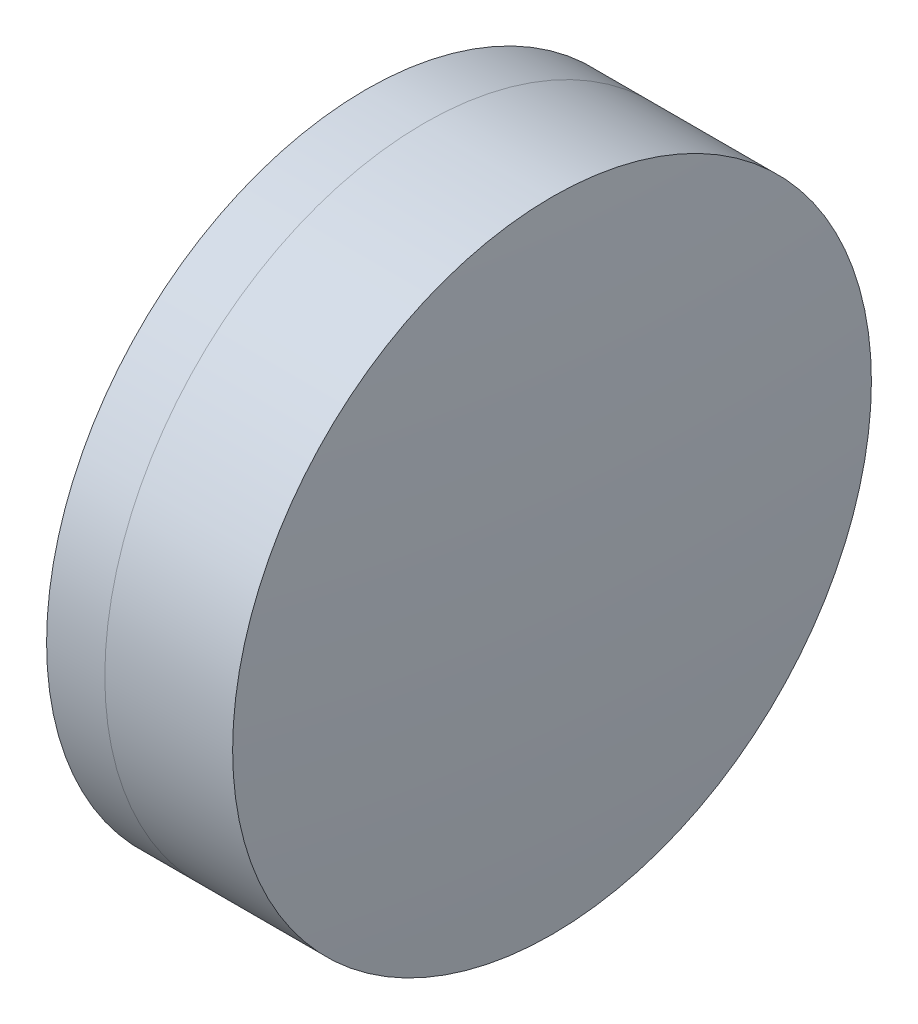
ISO-10303-21;
HEADER;
FILE_DESCRIPTION(('STEP AP214'),'2;1');
FILE_NAME('part.step','',(''),(''),'','','');
FILE_SCHEMA(('AUTOMOTIVE_DESIGN { 1 0 10303 214 1 1 1 1 }'));
ENDSEC;
DATA;
#1=APPLICATION_CONTEXT('core data for automotive mechanical design processes');
#2=APPLICATION_PROTOCOL_DEFINITION('international standard','automotive_design',2000,#1);
#3=PRODUCT_CONTEXT('',#1,'mechanical');
#4=PRODUCT('Part','Part','',(#3));
#5=PRODUCT_RELATED_PRODUCT_CATEGORY('part','',(#4));
#6=PRODUCT_DEFINITION_FORMATION('','',#4);
#7=PRODUCT_DEFINITION_CONTEXT('part definition',#1,'design');
#8=PRODUCT_DEFINITION('design','',#6,#7);
#9=PRODUCT_DEFINITION_SHAPE('','',#8);
#10=(LENGTH_UNIT() NAMED_UNIT(*) SI_UNIT(.MILLI.,.METRE.));
#11=(NAMED_UNIT(*) PLANE_ANGLE_UNIT() SI_UNIT($,.RADIAN.));
#12=(NAMED_UNIT(*) SI_UNIT($,.STERADIAN.) SOLID_ANGLE_UNIT());
#13=UNCERTAINTY_MEASURE_WITH_UNIT(LENGTH_MEASURE(1.E-05),#10,'distance_accuracy_value','');
#14=(GEOMETRIC_REPRESENTATION_CONTEXT(3) GLOBAL_UNCERTAINTY_ASSIGNED_CONTEXT((#13)) GLOBAL_UNIT_ASSIGNED_CONTEXT((#10,
#11,#12)) REPRESENTATION_CONTEXT('',''));
#15=CARTESIAN_POINT('',(0.,0.,0.));
#16=DIRECTION('',(0.,0.,1.));
#17=DIRECTION('',(1.,0.,0.));
#18=AXIS2_PLACEMENT_3D('',#15,#16,#17);
#19=CARTESIAN_POINT('',(260.70895665047,0.,0.));
#20=DIRECTION('',(-1.,0.,0.));
#21=DIRECTION('',(0.,0.,1.));
#22=AXIS2_PLACEMENT_3D('',#19,#20,#21);
#23=SPHERICAL_SURFACE('',#22,16.2);
#24=CARTESIAN_POINT('',(275.612563596441,0.,0.));
#25=DIRECTION('',(-1.,0.,0.));
#26=DIRECTION('',(0.,0.,1.));
#27=AXIS2_PLACEMENT_3D('',#24,#25,#26);
#28=CIRCLE('',#27,6.35);
#29=CARTESIAN_POINT('',(275.612563596441,0.,6.35));
#30=VERTEX_POINT('',#29);
#31=EDGE_CURVE('E11',#30,#30,#28,.T.);
#32=ORIENTED_EDGE('',*,*,#31,.T.);
#33=EDGE_LOOP('',(#32));
#34=FACE_BOUND('',#33,.T.);
#35=ADVANCED_FACE('F45',(#34),#23,.F.);
#36=CARTESIAN_POINT('',(-0.551919992657797,0.,0.));
#37=DIRECTION('',(-1.,0.,0.));
#38=DIRECTION('',(0.,0.,1.));
#39=AXIS2_PLACEMENT_3D('',#36,#37,#38);
#40=CYLINDRICAL_SURFACE('',#39,6.35);
#41=CARTESIAN_POINT('',(278.153661609015,0.,0.));
#42=DIRECTION('',(-1.,0.,0.));
#43=DIRECTION('',(0.,0.,1.));
#44=AXIS2_PLACEMENT_3D('',#41,#42,#43);
#45=CIRCLE('',#44,6.35);
#46=CARTESIAN_POINT('',(278.153661609015,0.,6.35));
#47=VERTEX_POINT('',#46);
#48=EDGE_CURVE('E51',#47,#47,#45,.T.);
#49=ORIENTED_EDGE('',*,*,#48,.T.);
#50=EDGE_LOOP('',(#49));
#51=FACE_BOUND('',#50,.T.);
#52=ORIENTED_EDGE('',*,*,#31,.F.);
#53=EDGE_LOOP('',(#52));
#54=FACE_BOUND('',#53,.T.);
#55=ADVANCED_FACE('F57',(#51,#54),#40,.T.);
#56=CARTESIAN_POINT('',(199.30895665047,0.,0.));
#57=DIRECTION('',(-1.,0.,0.));
#58=DIRECTION('',(0.,0.,1.));
#59=AXIS2_PLACEMENT_3D('',#56,#57,#58);
#60=SPHERICAL_SURFACE('',#59,79.1);
#61=ORIENTED_EDGE('',*,*,#48,.F.);
#62=EDGE_LOOP('',(#61));
#63=FACE_BOUND('',#62,.T.);
#64=ADVANCED_FACE('F60',(#63),#60,.T.);
#65=CLOSED_SHELL('',(#35,#55,#64));
#66=MANIFOLD_SOLID_BREP('B2',#65);
#67=CARTESIAN_POINT('',(293.20895665047,0.,0.));
#68=DIRECTION('',(-1.,0.,0.));
#69=DIRECTION('',(0.,0.,1.));
#70=AXIS2_PLACEMENT_3D('',#67,#68,#69);
#71=SPHERICAL_SURFACE('',#70,19.8);
#72=CARTESIAN_POINT('',(274.454823772622,0.,0.));
#73=DIRECTION('',(-1.,0.,0.));
#74=DIRECTION('',(0.,0.,1.));
#75=AXIS2_PLACEMENT_3D('',#72,#73,#74);
#76=CIRCLE('',#75,6.35);
#77=CARTESIAN_POINT('',(274.454823772622,0.,6.35));
#78=VERTEX_POINT('',#77);
#79=EDGE_CURVE('E44',#78,#78,#76,.T.);
#80=ORIENTED_EDGE('',*,*,#79,.T.);
#81=EDGE_LOOP('',(#80));
#82=FACE_BOUND('',#81,.T.);
#83=ADVANCED_FACE('F86',(#82),#71,.T.);
#84=CARTESIAN_POINT('',(124.523309526045,0.,0.));
#85=DIRECTION('',(-1.,0.,0.));
#86=DIRECTION('',(0.,0.,1.));
#87=AXIS2_PLACEMENT_3D('',#84,#85,#86);
#88=CYLINDRICAL_SURFACE('',#87,6.35);
#89=CARTESIAN_POINT('',(275.612563596441,0.,0.));
#90=DIRECTION('',(-1.,0.,0.));
#91=DIRECTION('',(0.,0.,1.));
#92=AXIS2_PLACEMENT_3D('',#89,#90,#91);
#93=CIRCLE('',#92,6.35);
#94=CARTESIAN_POINT('',(275.612563596441,0.,6.35));
#95=VERTEX_POINT('',#94);
#96=EDGE_CURVE('E92',#95,#95,#93,.T.);
#97=ORIENTED_EDGE('',*,*,#96,.T.);
#98=EDGE_LOOP('',(#97));
#99=FACE_BOUND('',#98,.T.);
#100=ORIENTED_EDGE('',*,*,#79,.F.);
#101=EDGE_LOOP('',(#100));
#102=FACE_BOUND('',#101,.T.);
#103=ADVANCED_FACE('F98',(#99,#102),#88,.T.);
#104=CARTESIAN_POINT('',(260.70895665047,0.,0.));
#105=DIRECTION('',(-1.,0.,0.));
#106=DIRECTION('',(0.,0.,1.));
#107=AXIS2_PLACEMENT_3D('',#104,#105,#106);
#108=SPHERICAL_SURFACE('',#107,16.2);
#109=ORIENTED_EDGE('',*,*,#96,.F.);
#110=EDGE_LOOP('',(#109));
#111=FACE_BOUND('',#110,.T.);
#112=ADVANCED_FACE('F101',(#111),#108,.T.);
#113=CLOSED_SHELL('',(#83,#103,#112));
#114=MANIFOLD_SOLID_BREP('B6',#113);
#115=ADVANCED_BREP_SHAPE_REPRESENTATION('',(#18,#66,#114),#14);
#116=SHAPE_DEFINITION_REPRESENTATION(#9,#115);
ENDSEC;
END-ISO-10303-21;
